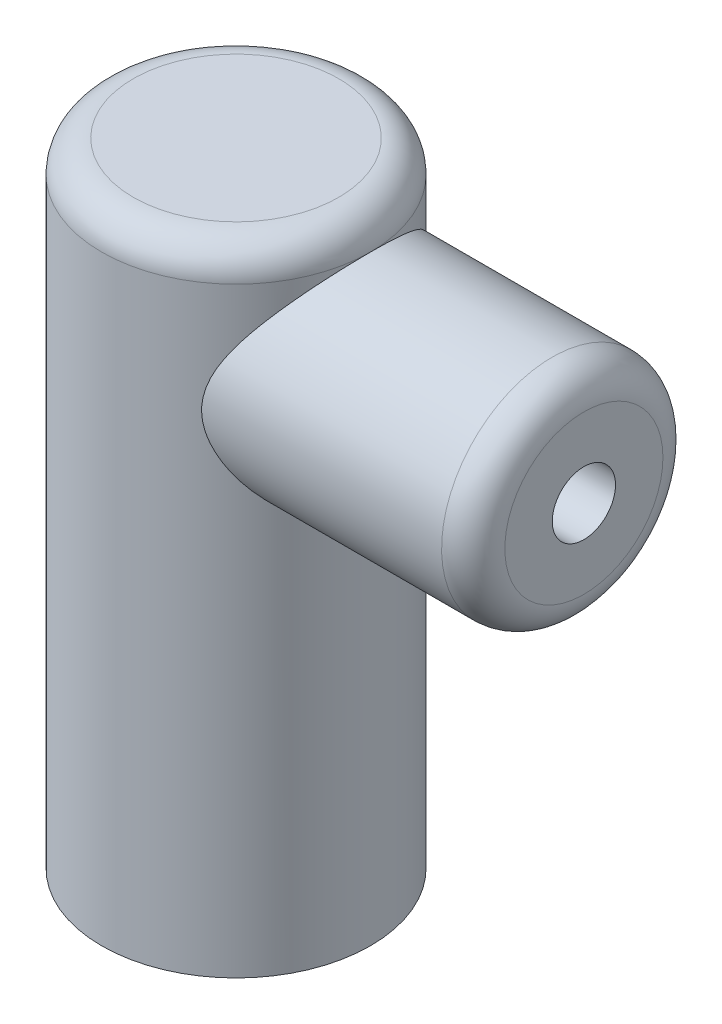
ISO-10303-21;
HEADER;
FILE_DESCRIPTION(('STEP AP214'),'2;1');
FILE_NAME('part.step','',(''),(''),'','','');
FILE_SCHEMA(('AUTOMOTIVE_DESIGN { 1 0 10303 214 1 1 1 1 }'));
ENDSEC;
DATA;
#1=APPLICATION_CONTEXT('core data for automotive mechanical design processes');
#2=APPLICATION_PROTOCOL_DEFINITION('international standard','automotive_design',2000,#1);
#3=PRODUCT_CONTEXT('',#1,'mechanical');
#4=PRODUCT('Part','Part','',(#3));
#5=PRODUCT_RELATED_PRODUCT_CATEGORY('part','',(#4));
#6=PRODUCT_DEFINITION_FORMATION('','',#4);
#7=PRODUCT_DEFINITION_CONTEXT('part definition',#1,'design');
#8=PRODUCT_DEFINITION('design','',#6,#7);
#9=PRODUCT_DEFINITION_SHAPE('','',#8);
#10=(LENGTH_UNIT() NAMED_UNIT(*) SI_UNIT(.MILLI.,.METRE.));
#11=(NAMED_UNIT(*) PLANE_ANGLE_UNIT() SI_UNIT($,.RADIAN.));
#12=(NAMED_UNIT(*) SI_UNIT($,.STERADIAN.) SOLID_ANGLE_UNIT());
#13=UNCERTAINTY_MEASURE_WITH_UNIT(LENGTH_MEASURE(1.E-05),#10,'distance_accuracy_value','');
#14=(GEOMETRIC_REPRESENTATION_CONTEXT(3) GLOBAL_UNCERTAINTY_ASSIGNED_CONTEXT((#13)) GLOBAL_UNIT_ASSIGNED_CONTEXT((#10,
#11,#12)) REPRESENTATION_CONTEXT('',''));
#15=CARTESIAN_POINT('',(0.,0.,0.));
#16=DIRECTION('',(0.,0.,1.));
#17=DIRECTION('',(1.,0.,0.));
#18=AXIS2_PLACEMENT_3D('',#15,#16,#17);
#19=CARTESIAN_POINT('',(0.,200.,0.));
#20=DIRECTION('',(0.,-1.,0.));
#21=DIRECTION('',(0.,0.,-1.));
#22=AXIS2_PLACEMENT_3D('',#19,#20,#21);
#23=CYLINDRICAL_SURFACE('',#22,42.5);
#24=CARTESIAN_POINT('',(0.,0.,0.));
#25=DIRECTION('',(0.,1.,0.));
#26=DIRECTION('',(0.,0.,1.));
#27=AXIS2_PLACEMENT_3D('',#24,#25,#26);
#28=CIRCLE('',#27,42.5);
#29=CARTESIAN_POINT('',(0.,0.,42.5));
#30=VERTEX_POINT('',#29);
#31=EDGE_CURVE('E65',#30,#30,#28,.T.);
#32=ORIENTED_EDGE('',*,*,#31,.T.);
#33=EDGE_LOOP('',(#32));
#34=FACE_BOUND('',#33,.T.);
#35=CARTESIAN_POINT('',(24.1091269024824,155.,35.));
#36=CARTESIAN_POINT('',(24.109144116349,154.369580555447,34.9999933033889));
#37=CARTESIAN_POINT('',(24.1339807896554,153.738989633027,34.9829201330865));
#38=CARTESIAN_POINT('',(24.2320409000779,152.483173039553,34.9150622819182));
#39=CARTESIAN_POINT('',(24.3052945978711,151.857950971751,34.8642565180653));
#40=CARTESIAN_POINT('',(24.4967277254122,150.616267582926,34.7300149179889));
#41=CARTESIAN_POINT('',(24.6150307906742,149.999835258718,34.6464892655435));
#42=CARTESIAN_POINT('',(24.8912020466167,148.781114436406,34.4486112138779));
#43=CARTESIAN_POINT('',(25.0490705935652,148.178826065714,34.3342585370747));
#44=CARTESIAN_POINT('',(25.4640931589299,146.767093372393,34.0282080527054));
#45=CARTESIAN_POINT('',(25.7362634759287,145.964859608073,33.8235935171676));
#46=CARTESIAN_POINT('',(26.3290738615771,144.393364684492,33.3642078147039));
#47=CARTESIAN_POINT('',(26.649737816113,143.62412001525,33.1094119117871));
#48=CARTESIAN_POINT('',(27.3270848190682,142.116914952367,32.552621407464));
#49=CARTESIAN_POINT('',(27.6838577091993,141.379039415659,32.2505080018764));
#50=CARTESIAN_POINT('',(28.4217651117175,139.935756872533,31.6021277153579));
#51=CARTESIAN_POINT('',(28.8028986750918,139.230348603135,31.255862553914));
#52=CARTESIAN_POINT('',(29.4675587242691,138.051553466709,30.6277200083681));
#53=CARTESIAN_POINT('',(29.7472547292273,137.570324668932,30.3563829941905));
#54=CARTESIAN_POINT('',(30.3118014178767,136.623387820529,29.7926799637585));
#55=CARTESIAN_POINT('',(30.596652484685,136.15768093084,29.5003123796981));
#56=CARTESIAN_POINT('',(31.1691856471983,135.241557934973,28.8947322720906));
#57=CARTESIAN_POINT('',(31.4568685910821,134.791146601569,28.5815133307896));
#58=CARTESIAN_POINT('',(32.0328526611075,133.905769922108,27.9344604761189));
#59=CARTESIAN_POINT('',(32.3211538419368,133.47080600776,27.6006246597338));
#60=CARTESIAN_POINT('',(33.1834350411128,132.190141185979,26.5690023825928));
#61=CARTESIAN_POINT('',(33.755464342043,131.367607004534,25.8404000996342));
#62=CARTESIAN_POINT('',(34.879502584609,129.788164211119,24.3018108099273));
#63=CARTESIAN_POINT('',(35.4315187730531,129.031231703697,23.4918536708029));
#64=CARTESIAN_POINT('',(36.3910411335628,127.738227875961,21.9676161326934));
#65=CARTESIAN_POINT('',(36.8047419369442,127.188944405191,21.2684231386584));
#66=CARTESIAN_POINT('',(37.6046887429783,126.138633958662,19.8197336210164));
#67=CARTESIAN_POINT('',(37.9909358657603,125.63760501379,19.0702391521732));
#68=CARTESIAN_POINT('',(38.7287366943712,124.689049529047,17.5233647077875));
#69=CARTESIAN_POINT('',(39.0803347747587,124.241454397643,16.7260481404061));
#70=CARTESIAN_POINT('',(39.7425395451134,123.404351548962,15.085183902923));
#71=CARTESIAN_POINT('',(40.0531534793446,123.014833564515,14.2416444404813));
#72=CARTESIAN_POINT('',(40.5779874405307,122.360231394054,12.6589666481398));
#73=CARTESIAN_POINT('',(40.7996220335838,122.085246786672,11.9263711998335));
#74=CARTESIAN_POINT('',(41.2062283008463,121.582562769557,10.4352144098018));
#75=CARTESIAN_POINT('',(41.391203808074,121.354858416153,9.67665579248249));
#76=CARTESIAN_POINT('',(41.7210157408059,120.949934675668,8.13791582165729));
#77=CARTESIAN_POINT('',(41.86586776934,120.772695663111,7.35774300357778));
#78=CARTESIAN_POINT('',(42.1126270597445,120.471303916865,5.78046106855623));
#79=CARTESIAN_POINT('',(42.2145338219223,120.347151800871,4.98335175466177));
#80=CARTESIAN_POINT('',(42.3735384783194,120.153625357556,3.37476014399933));
#81=CARTESIAN_POINT('',(42.4304544482362,120.084473421518,2.56323292400518));
#82=CARTESIAN_POINT('',(42.4975130508196,120.003012222891,0.93538630068529));
#83=CARTESIAN_POINT('',(42.5076555876615,119.990703076755,0.119066887545224));
#84=CARTESIAN_POINT('',(42.4809362227141,120.02315016617,-1.51164080281082));
#85=CARTESIAN_POINT('',(42.4440751490446,120.067905396348,-2.32602911379612));
#86=CARTESIAN_POINT('',(42.3241859576354,120.213674576732,-3.94628377312993));
#87=CARTESIAN_POINT('',(42.2411592625876,120.31468679326,-4.75215038331296));
#88=CARTESIAN_POINT('',(42.0374583698247,120.563063419629,-6.29851445820613));
#89=CARTESIAN_POINT('',(41.9195072796505,120.707079974875,-7.03991516587761));
#90=CARTESIAN_POINT('',(41.6468952197124,121.040860520042,-8.50538551681051));
#91=CARTESIAN_POINT('',(41.4922361415418,121.23062215269,-9.22945605099444));
#92=CARTESIAN_POINT('',(41.1488213673743,121.653475214631,-10.6566097709098));
#93=CARTESIAN_POINT('',(40.9600606704954,121.886572999164,-11.359689860822));
#94=CARTESIAN_POINT('',(40.5514237117821,122.393398956096,-12.7417190982193));
#95=CARTESIAN_POINT('',(40.3315456126257,122.667129527698,-13.4206668178486));
#96=CARTESIAN_POINT('',(39.8429850772002,123.278552728901,-14.8113819440679));
#97=CARTESIAN_POINT('',(39.5716996663059,123.619771406967,-15.5206828270397));
#98=CARTESIAN_POINT('',(39.0001563640812,124.343654219033,-16.9055941709998));
#99=CARTESIAN_POINT('',(38.6998970687752,124.726320361546,-17.5812029969775));
#100=CARTESIAN_POINT('',(38.0745191516996,125.529968788828,-18.8974073668099));
#101=CARTESIAN_POINT('',(37.7493941542164,125.950960905907,-19.5379938580399));
#102=CARTESIAN_POINT('',(37.0784915178842,126.828304441735,-20.7830617562839));
#103=CARTESIAN_POINT('',(36.7327128658368,127.284657595504,-21.3875413891034));
#104=CARTESIAN_POINT('',(35.9510630614449,128.328436016172,-22.6815959809241));
#105=CARTESIAN_POINT('',(35.511387238714,128.923408153392,-23.3627966550403));
#106=CARTESIAN_POINT('',(34.6149812757496,130.157955169539,-24.6714873410868));
#107=CARTESIAN_POINT('',(34.1582485522642,130.797536817365,-25.2989691695803));
#108=CARTESIAN_POINT('',(33.2344387856637,132.11983042337,-26.5008927440641));
#109=CARTESIAN_POINT('',(32.7673477912127,132.802603174835,-27.0752567954144));
#110=CARTESIAN_POINT('',(31.8313786645481,134.209079113957,-28.1696935653511));
#111=CARTESIAN_POINT('',(31.3625006771722,134.932779047562,-28.6897705908808));
#112=CARTESIAN_POINT('',(30.4411061286621,136.406052561108,-29.6653009371319));
#113=CARTESIAN_POINT('',(29.9884498109046,137.154821015305,-30.1218372394161));
#114=CARTESIAN_POINT('',(29.0997407595218,138.692371417028,-30.9812374405547));
#115=CARTESIAN_POINT('',(28.6636914723461,139.48116159188,-31.3840902413788));
#116=CARTESIAN_POINT('',(27.8212819214794,141.098569548182,-32.1332127703566));
#117=CARTESIAN_POINT('',(27.4148727165001,141.927117749679,-32.4795769972687));
#118=CARTESIAN_POINT('',(26.6464876050765,143.62639619442,-33.1128716569087));
#119=CARTESIAN_POINT('',(26.2844849999021,144.497100648322,-33.3998378737553));
#120=CARTESIAN_POINT('',(25.7445721698185,145.955147591282,-33.8162312800062));
#121=CARTESIAN_POINT('',(25.5476786130233,146.529994128178,-33.9649404187285));
#122=CARTESIAN_POINT('',(25.1851728254214,147.695906369798,-34.2346034575806));
#123=CARTESIAN_POINT('',(25.0195565007118,148.286969940246,-34.355560990587));
#124=CARTESIAN_POINT('',(24.7257109661857,149.482264017055,-34.5676452918854));
#125=CARTESIAN_POINT('',(24.5974004052515,150.086462737966,-34.6588370233398));
#126=CARTESIAN_POINT('',(24.3830566419295,151.306262869453,-34.8099676845401));
#127=CARTESIAN_POINT('',(24.2970222205602,151.921863950724,-34.8699075153999));
#128=CARTESIAN_POINT('',(24.1708242762511,153.165685533241,-34.9575072897095));
#129=CARTESIAN_POINT('',(24.1310764462856,153.793969607442,-34.9848747531072));
#130=CARTESIAN_POINT('',(24.1009788606689,155.052271692915,-35.0056163215024));
#131=CARTESIAN_POINT('',(24.1106270125899,155.68228962961,-34.9989918664071));
#132=CARTESIAN_POINT('',(24.1788208945623,156.938927577378,-34.9519139228089));
#133=CARTESIAN_POINT('',(24.2374103556555,157.565544044922,-34.9114301796205));
#134=CARTESIAN_POINT('',(24.4004776174839,158.80973213164,-34.7976499588347));
#135=CARTESIAN_POINT('',(24.5049625164107,159.427302336446,-34.7243484055988));
#136=CARTESIAN_POINT('',(24.7787000188258,160.765453629501,-34.5296871646768));
#137=CARTESIAN_POINT('',(24.9564813786516,161.483339782266,-34.4018468109058));
#138=CARTESIAN_POINT('',(25.3603432613096,162.896606052821,-34.105212373137));
#139=CARTESIAN_POINT('',(25.5864365168466,163.591980181777,-33.9364074912548));
#140=CARTESIAN_POINT('',(26.0776826426794,164.960141321715,-33.5603982983539));
#141=CARTESIAN_POINT('',(26.3429382589091,165.632863020201,-33.3530925963355));
#142=CARTESIAN_POINT('',(26.9031276295858,166.953494202606,-32.9028993396459));
#143=CARTESIAN_POINT('',(27.1980632176493,167.601402150124,-32.6600095861835));
#144=CARTESIAN_POINT('',(27.7414828569742,168.730505568017,-32.1987158271231));
#145=CARTESIAN_POINT('',(27.9855993288177,169.216572624372,-31.9869886908371));
#146=CARTESIAN_POINT('',(28.4840946806353,170.174350149901,-31.5438987457715));
#147=CARTESIAN_POINT('',(28.7384747035183,170.646059009884,-31.3125337470125));
#148=CARTESIAN_POINT('',(29.2549053792374,171.575550718117,-30.8305903021719));
#149=CARTESIAN_POINT('',(29.5169592824851,172.033327492741,-30.5800036394458));
#150=CARTESIAN_POINT('',(30.0462780280439,172.934932957559,-30.0600883878983));
#151=CARTESIAN_POINT('',(30.3135427010669,173.378762099665,-29.7907604072193));
#152=CARTESIAN_POINT('',(31.1206635196169,174.690677160637,-28.9543508205841));
#153=CARTESIAN_POINT('',(31.6653116448631,175.538244670161,-28.3593355375048));
#154=CARTESIAN_POINT('',(32.7526412519324,177.177942608503,-27.0962984822016));
#155=CARTESIAN_POINT('',(33.2953230810556,177.970083330138,-26.4282903241745));
#156=CARTESIAN_POINT('',(34.3829006560159,179.520360279584,-24.9979555277009));
#157=CARTESIAN_POINT('',(34.9273622210808,180.276730815455,-24.2333790254023));
#158=CARTESIAN_POINT('',(35.9889816373985,181.724498266931,-22.6267551371843));
#159=CARTESIAN_POINT('',(36.5061348587855,182.41588418042,-21.7846946805566));
#160=CARTESIAN_POINT('',(37.251241027102,183.398064112907,-20.4658133699474));
#161=CARTESIAN_POINT('',(37.4942540792765,183.715986440819,-20.0174140874554));
#162=CARTESIAN_POINT('',(37.9688331375197,184.332937169202,-19.1019221508279));
#163=CARTESIAN_POINT('',(38.2003998495444,184.631966735207,-18.6348306527629));
#164=CARTESIAN_POINT('',(38.6503934657028,185.209861723029,-17.6825972147274));
#165=CARTESIAN_POINT('',(38.868827521065,185.488738136022,-17.1974653357028));
#166=CARTESIAN_POINT('',(39.2911658271326,186.025362362867,-16.2093519303902));
#167=CARTESIAN_POINT('',(39.4950666651489,186.283105216261,-15.7063662529405));
#168=CARTESIAN_POINT('',(39.9617708553149,186.870614812976,-14.487256751558));
#169=CARTESIAN_POINT('',(40.2172099898158,187.190140784834,-13.7633080306653));
#170=CARTESIAN_POINT('',(40.6929503627197,187.782576937913,-12.285606568024));
#171=CARTESIAN_POINT('',(40.9132607764861,188.055499292981,-11.5318616732147));
#172=CARTESIAN_POINT('',(41.3147950049561,188.551205757138,-9.99827633863658));
#173=CARTESIAN_POINT('',(41.4960383253829,188.774014889574,-9.21844914716669));
#174=CARTESIAN_POINT('',(41.8160125289116,189.166384119767,-7.63688183296258));
#175=CARTESIAN_POINT('',(41.9547422135317,189.335942716367,-6.83514109316761));
#176=CARTESIAN_POINT('',(42.187361355377,189.619793762307,-5.21087176073402));
#177=CARTESIAN_POINT('',(42.2810023992382,189.733780081405,-4.38825371048788));
#178=CARTESIAN_POINT('',(42.4201707448668,189.903054510551,-2.7329307424937));
#179=CARTESIAN_POINT('',(42.4656981595955,189.95834275841,-1.90022584843222));
#180=CARTESIAN_POINT('',(42.5075576969748,190.009179784858,-0.231859798571621));
#181=CARTESIAN_POINT('',(42.5038960583349,190.004736139317,0.603800968889862));
#182=CARTESIAN_POINT('',(42.4474764902901,189.936208220153,2.2709689546584));
#183=CARTESIAN_POINT('',(42.3947211544893,189.872127097158,3.10247639005159));
#184=CARTESIAN_POINT('',(42.2477514791521,189.693296785335,4.68575327694699));
#185=CARTESIAN_POINT('',(42.1573431167778,189.583196269004,5.4384110444809));
#186=CARTESIAN_POINT('',(41.9380524744517,189.315537824192,6.92946833560321));
#187=CARTESIAN_POINT('',(41.8091727766414,189.157983080767,7.66786881258048));
#188=CARTESIAN_POINT('',(41.5152557823321,188.797593546155,9.1261660033717));
#189=CARTESIAN_POINT('',(41.3502168929955,188.594756760257,9.8460619004846));
#190=CARTESIAN_POINT('',(40.9867476909895,188.146353036506,11.2637524783361));
#191=CARTESIAN_POINT('',(40.7883154163228,187.900783587908,11.9615458575977));
#192=CARTESIAN_POINT('',(40.3482857025657,187.35370386355,13.3732882061726));
#193=CARTESIAN_POINT('',(40.1048118896067,187.049720066226,14.0856915882014));
#194=CARTESIAN_POINT('',(39.5876117835045,186.400121469394,15.4797884367948));
#195=CARTESIAN_POINT('',(39.3138850936957,186.054506124022,16.161481500531));
#196=CARTESIAN_POINT('',(38.7399424761209,185.324643415158,17.492641605581));
#197=CARTESIAN_POINT('',(38.4397140998461,184.940377884757,18.1420932761084));
#198=CARTESIAN_POINT('',(37.8166848831181,184.136168949526,19.4073623014547));
#199=CARTESIAN_POINT('',(37.4938796121909,183.716218538425,20.0231730121266));
#200=CARTESIAN_POINT('',(36.9184804761094,182.960100030678,21.0600859288103));
#201=CARTESIAN_POINT('',(36.6702058416059,182.631573055538,21.4892048632023));
#202=CARTESIAN_POINT('',(36.1651752550817,181.957736699448,22.3286825857204));
#203=CARTESIAN_POINT('',(35.9084207462345,181.612430169512,22.7390445380096));
#204=CARTESIAN_POINT('',(35.1273353063363,180.552083951423,23.9423189358797));
#205=CARTESIAN_POINT('',(34.5923105148656,179.812784714512,24.7071917857432));
#206=CARTESIAN_POINT('',(33.5050024348189,178.2730139489,26.1627991096798));
#207=CARTESIAN_POINT('',(32.9526861900428,177.472420800189,26.8533792843033));
#208=CARTESIAN_POINT('',(31.8447254119797,175.813888233032,28.158396277044));
#209=CARTESIAN_POINT('',(31.2890818197065,174.955964390088,28.7728536476471));
#210=CARTESIAN_POINT('',(30.2883763604854,173.342850699163,29.8209779676679));
#211=CARTESIAN_POINT('',(29.841428487091,172.597001978314,30.267271600765));
#212=CARTESIAN_POINT('',(28.9649937630786,171.065964286654,31.1070284140741));
#213=CARTESIAN_POINT('',(28.5355092150414,170.280770158332,31.500484643197));
#214=CARTESIAN_POINT('',(27.7071842885278,168.671614439614,32.2314494959254));
#215=CARTESIAN_POINT('',(27.3082785906982,167.847741909907,32.5690792638945));
#216=CARTESIAN_POINT('',(26.5554801267719,166.158601083055,33.1857342257335));
#217=CARTESIAN_POINT('',(26.201560288575,165.293358117901,33.4647947325602));
#218=CARTESIAN_POINT('',(25.6688552554143,163.827878205227,33.8737477477291));
#219=CARTESIAN_POINT('',(25.4718028359175,163.239338588151,34.0218698646593));
#220=CARTESIAN_POINT('',(25.1110530375758,162.045467864729,34.2889981703046));
#221=CARTESIAN_POINT('',(24.9473564890271,161.440136340822,34.408003634261));
#222=CARTESIAN_POINT('',(24.6599486703108,160.216824232319,34.6145671266489));
#223=CARTESIAN_POINT('',(24.5361092004101,159.598891141023,34.7022260838274));
#224=CARTESIAN_POINT('',(24.3333050845834,158.352187624899,34.8447389624851));
#225=CARTESIAN_POINT('',(24.2543103895072,157.723424748549,34.8996148522165));
#226=CARTESIAN_POINT('',(24.1696634090026,156.744341696968,34.9582401394468));
#227=CARTESIAN_POINT('',(24.147003011616,156.396105223705,34.973884441717));
#228=CARTESIAN_POINT('',(24.1167284723043,155.698596847036,34.994767276351));
#229=CARTESIAN_POINT('',(24.109117364024,155.349324749076,35.0000037106914));
#230=CARTESIAN_POINT('',(24.1091269024824,155.,35.));
#231=B_SPLINE_CURVE_WITH_KNOTS('',3,(#35,#36,#37,#38,#39,#40,#41,#42,#43,#44,#45,#46,#47,#48,
#49,#50,#51,#52,#53,#54,#55,#56,#57,#58,#59,#60,#61,#62,#63,#64,#65,#66,#67,#68,#69,#70,#71,#72,
#73,#74,#75,#76,#77,#78,#79,#80,#81,#82,#83,#84,#85,#86,#87,#88,#89,#90,#91,#92,#93,#94,#95,#96,
#97,#98,#99,#100,#101,#102,#103,#104,#105,#106,#107,#108,#109,#110,#111,#112,#113,#114,#115,
#116,#117,#118,#119,#120,#121,#122,#123,#124,#125,#126,#127,#128,#129,#130,#131,#132,#133,#134,
#135,#136,#137,#138,#139,#140,#141,#142,#143,#144,#145,#146,#147,#148,#149,#150,#151,#152,#153,
#154,#155,#156,#157,#158,#159,#160,#161,#162,#163,#164,#165,#166,#167,#168,#169,#170,#171,#172,
#173,#174,#175,#176,#177,#178,#179,#180,#181,#182,#183,#184,#185,#186,#187,#188,#189,#190,#191,
#192,#193,#194,#195,#196,#197,#198,#199,#200,#201,#202,#203,#204,#205,#206,#207,#208,#209,#210,
#211,#212,#213,#214,#215,#216,#217,#218,#219,#220,#221,#222,#223,#224,#225,#226,#227,#228,#229,
#230),.UNSPECIFIED.,.T.,.F.,(4,2,2,2,2,2,2,2,2,2,2,2,2,2,2,2,2,2,2,2,2,2,2,2,2,2,2,2,2,2,2,2,2,
2,2,2,2,2,2,2,2,2,2,2,2,2,2,2,2,2,2,2,2,2,2,2,2,2,2,2,2,2,2,2,2,2,2,2,2,2,2,2,2,2,2,2,2,2,2,2,2,
2,2,2,2,2,2,2,2,2,2,2,2,2,2,2,2,4),(0.,1.89085414030973,3.78289118482324,5.68015868782855,
7.57744327542667,10.1877367181751,12.7993200925606,15.4175689397017,18.0357158504501,
19.8928392863497,21.7501013125493,23.6079376446416,25.4659457190926,29.1776626131309,
32.8880217793446,35.8274545247577,38.7667672703503,41.7022653765465,44.6372439137339,
47.0746825876748,49.5118662721162,51.9481008611837,54.3843637964435,56.8304282934239,
59.2764978016482,61.7225242150879,64.1684752531991,66.4592248034715,68.7498563351264,
71.0408240528957,73.3319270969686,75.8271861508665,78.3225661772779,80.8185881929656,
83.3147327557721,86.3289016791131,89.3435289617228,92.3624981746664,95.3812276907924,
98.339683272432,101.298749512118,104.252813646295,107.205092901723,109.080431996085,
110.955525455372,112.826498770432,114.697418135066,116.585013436053,118.472528778632,
120.361732498975,122.25122850663,124.499336872345,126.748038464278,129.002748162384,
131.257597241155,133.008044151541,134.758686525764,136.510081459056,138.261419587292,
141.767664273906,145.2732561093,148.885413267109,152.498180877894,154.300585077788,
156.102877974898,157.904180396575,159.705904415859,162.197945539541,164.689334690402,
167.179477024832,169.66968955124,172.173469089145,174.677242748657,177.18069885441,
179.684022710907,181.979498488505,184.274820231654,186.570243105664,188.865800892233,
191.299189473984,193.732609965303,196.167179640637,198.602228422062,200.385853022137,
202.169175619114,205.736748854735,209.31159412454,212.885472104401,215.815419404897,
218.74575178137,221.669639374547,224.591758981862,226.504526488477,228.417341601999,
230.323941215269,232.229261760294,233.276800895938,234.324551173647),.UNSPECIFIED.);
#232=CARTESIAN_POINT('',(42.5,190.,0.));
#233=VERTEX_POINT('',#232);
#234=EDGE_CURVE('E56',#233,#233,#231,.T.);
#235=ORIENTED_EDGE('',*,*,#234,.F.);
#236=CARTESIAN_POINT('',(0.,190.,0.));
#237=DIRECTION('',(0.,1.,0.));
#238=DIRECTION('',(0.,0.,1.));
#239=AXIS2_PLACEMENT_3D('',#236,#237,#238);
#240=CIRCLE('',#239,42.5);
#241=EDGE_CURVE('E46',#233,#233,#240,.F.);
#242=ORIENTED_EDGE('',*,*,#241,.T.);
#243=EDGE_LOOP('',(#235,#242));
#244=FACE_BOUND('',#243,.T.);
#245=ADVANCED_FACE('F35',(#34,#244),#23,.T.);
#246=CARTESIAN_POINT('',(0.,200.,0.));
#247=DIRECTION('',(0.,1.,0.));
#248=DIRECTION('',(0.,0.,1.));
#249=AXIS2_PLACEMENT_3D('',#246,#247,#248);
#250=PLANE('',#249);
#251=CARTESIAN_POINT('',(0.,200.,0.));
#252=DIRECTION('',(0.,1.,0.));
#253=DIRECTION('',(0.,0.,1.));
#254=AXIS2_PLACEMENT_3D('',#251,#252,#253);
#255=CIRCLE('',#254,32.5);
#256=CARTESIAN_POINT('',(0.,200.,32.5));
#257=VERTEX_POINT('',#256);
#258=EDGE_CURVE('E52',#257,#257,#255,.T.);
#259=ORIENTED_EDGE('',*,*,#258,.T.);
#260=EDGE_LOOP('',(#259));
#261=FACE_BOUND('',#260,.T.);
#262=ADVANCED_FACE('F78',(#261),#250,.T.);
#263=CARTESIAN_POINT('',(0.,0.,0.));
#264=DIRECTION('',(0.,1.,0.));
#265=DIRECTION('',(0.,0.,1.));
#266=AXIS2_PLACEMENT_3D('',#263,#264,#265);
#267=PLANE('',#266);
#268=ORIENTED_EDGE('',*,*,#31,.F.);
#269=EDGE_LOOP('',(#268));
#270=FACE_BOUND('',#269,.T.);
#271=ADVANCED_FACE('F75',(#270),#267,.F.);
#272=CARTESIAN_POINT('',(110.,155.,0.));
#273=DIRECTION('',(-1.,0.,0.));
#274=DIRECTION('',(0.,0.,1.));
#275=AXIS2_PLACEMENT_3D('',#272,#273,#274);
#276=CYLINDRICAL_SURFACE('',#275,35.);
#277=CARTESIAN_POINT('',(100.,155.,0.));
#278=DIRECTION('',(1.,0.,0.));
#279=DIRECTION('',(0.,0.,-1.));
#280=AXIS2_PLACEMENT_3D('',#277,#278,#279);
#281=CIRCLE('',#280,35.);
#282=CARTESIAN_POINT('',(100.,155.,-35.));
#283=VERTEX_POINT('',#282);
#284=EDGE_CURVE('E11',#283,#283,#281,.F.);
#285=ORIENTED_EDGE('',*,*,#284,.T.);
#286=EDGE_LOOP('',(#285));
#287=FACE_BOUND('',#286,.T.);
#288=ORIENTED_EDGE('',*,*,#234,.T.);
#289=EDGE_LOOP('',(#288));
#290=FACE_BOUND('',#289,.T.);
#291=ADVANCED_FACE('F69',(#287,#290),#276,.T.);
#292=CARTESIAN_POINT('',(110.,155.,0.));
#293=DIRECTION('',(1.,0.,0.));
#294=DIRECTION('',(0.,0.,-1.));
#295=AXIS2_PLACEMENT_3D('',#292,#293,#294);
#296=PLANE('',#295);
#297=CARTESIAN_POINT('',(110.,155.,0.));
#298=DIRECTION('',(1.,0.,0.));
#299=DIRECTION('',(0.,0.,-1.));
#300=AXIS2_PLACEMENT_3D('',#297,#298,#299);
#301=CIRCLE('',#300,25.);
#302=CARTESIAN_POINT('',(110.,155.,-25.));
#303=VERTEX_POINT('',#302);
#304=EDGE_CURVE('E42',#303,#303,#301,.T.);
#305=ORIENTED_EDGE('',*,*,#304,.T.);
#306=EDGE_LOOP('',(#305));
#307=FACE_BOUND('',#306,.T.);
#308=CARTESIAN_POINT('',(110.,155.,0.));
#309=DIRECTION('',(1.,0.,0.));
#310=DIRECTION('',(0.,0.,-1.));
#311=AXIS2_PLACEMENT_3D('',#308,#309,#310);
#312=CIRCLE('',#311,10.);
#313=CARTESIAN_POINT('',(110.,155.,-10.));
#314=VERTEX_POINT('',#313);
#315=EDGE_CURVE('E94',#314,#314,#312,.T.);
#316=ORIENTED_EDGE('',*,*,#315,.F.);
#317=EDGE_LOOP('',(#316));
#318=FACE_BOUND('',#317,.T.);
#319=ADVANCED_FACE('F74',(#307,#318),#296,.T.);
#320=CARTESIAN_POINT('',(0.,190.,0.));
#321=DIRECTION('',(0.,1.,0.));
#322=DIRECTION('',(0.,0.,1.));
#323=AXIS2_PLACEMENT_3D('',#320,#321,#322);
#324=TOROIDAL_SURFACE('',#323,32.5,10.);
#325=ORIENTED_EDGE('',*,*,#241,.F.);
#326=EDGE_LOOP('',(#325));
#327=FACE_BOUND('',#326,.T.);
#328=ORIENTED_EDGE('',*,*,#258,.F.);
#329=EDGE_LOOP('',(#328));
#330=FACE_BOUND('',#329,.T.);
#331=ADVANCED_FACE('F47',(#327,#330),#324,.T.);
#332=CARTESIAN_POINT('',(70.,155.,0.));
#333=DIRECTION('',(1.,0.,0.));
#334=DIRECTION('',(0.,0.,-1.));
#335=AXIS2_PLACEMENT_3D('',#332,#333,#334);
#336=CYLINDRICAL_SURFACE('',#335,10.);
#337=CARTESIAN_POINT('',(70.,155.,0.));
#338=DIRECTION('',(1.,0.,0.));
#339=DIRECTION('',(0.,0.,-1.));
#340=AXIS2_PLACEMENT_3D('',#337,#338,#339);
#341=CIRCLE('',#340,10.);
#342=CARTESIAN_POINT('',(70.,155.,-10.));
#343=VERTEX_POINT('',#342);
#344=EDGE_CURVE('E92',#343,#343,#341,.T.);
#345=ORIENTED_EDGE('',*,*,#344,.F.);
#346=EDGE_LOOP('',(#345));
#347=FACE_BOUND('',#346,.T.);
#348=ORIENTED_EDGE('',*,*,#315,.T.);
#349=EDGE_LOOP('',(#348));
#350=FACE_BOUND('',#349,.T.);
#351=ADVANCED_FACE('F101',(#347,#350),#336,.F.);
#352=CARTESIAN_POINT('',(70.,155.,0.));
#353=DIRECTION('',(1.,0.,0.));
#354=DIRECTION('',(0.,0.,-1.));
#355=AXIS2_PLACEMENT_3D('',#352,#353,#354);
#356=PLANE('',#355);
#357=ORIENTED_EDGE('',*,*,#344,.T.);
#358=EDGE_LOOP('',(#357));
#359=FACE_BOUND('',#358,.T.);
#360=ADVANCED_FACE('F111',(#359),#356,.T.);
#361=CARTESIAN_POINT('',(100.,155.,0.));
#362=DIRECTION('',(1.,0.,0.));
#363=DIRECTION('',(0.,0.,-1.));
#364=AXIS2_PLACEMENT_3D('',#361,#362,#363);
#365=TOROIDAL_SURFACE('',#364,25.,10.);
#366=ORIENTED_EDGE('',*,*,#284,.F.);
#367=EDGE_LOOP('',(#366));
#368=FACE_BOUND('',#367,.T.);
#369=ORIENTED_EDGE('',*,*,#304,.F.);
#370=EDGE_LOOP('',(#369));
#371=FACE_BOUND('',#370,.T.);
#372=ADVANCED_FACE('F37',(#368,#371),#365,.T.);
#373=CLOSED_SHELL('',(#245,#262,#271,#291,#319,#331,#351,#360,#372));
#374=MANIFOLD_SOLID_BREP('B2',#373);
#375=ADVANCED_BREP_SHAPE_REPRESENTATION('',(#18,#374),#14);
#376=SHAPE_DEFINITION_REPRESENTATION(#9,#375);
ENDSEC;
END-ISO-10303-21;
